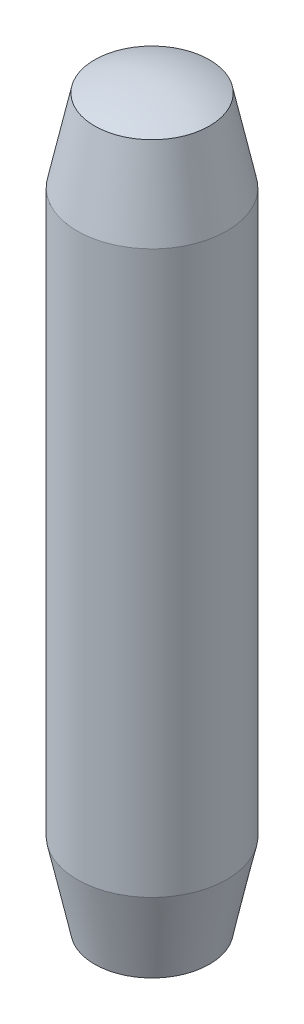
ISO-10303-21;
HEADER;
FILE_DESCRIPTION(('STEP AP214'),'2;1');
FILE_NAME('part.step','',(''),(''),'','','');
FILE_SCHEMA(('AUTOMOTIVE_DESIGN { 1 0 10303 214 1 1 1 1 }'));
ENDSEC;
DATA;
#1=APPLICATION_CONTEXT('core data for automotive mechanical design processes');
#2=APPLICATION_PROTOCOL_DEFINITION('international standard','automotive_design',2000,#1);
#3=PRODUCT_CONTEXT('',#1,'mechanical');
#4=PRODUCT('Part','Part','',(#3));
#5=PRODUCT_RELATED_PRODUCT_CATEGORY('part','',(#4));
#6=PRODUCT_DEFINITION_FORMATION('','',#4);
#7=PRODUCT_DEFINITION_CONTEXT('part definition',#1,'design');
#8=PRODUCT_DEFINITION('design','',#6,#7);
#9=PRODUCT_DEFINITION_SHAPE('','',#8);
#10=(LENGTH_UNIT() NAMED_UNIT(*) SI_UNIT(.MILLI.,.METRE.));
#11=(NAMED_UNIT(*) PLANE_ANGLE_UNIT() SI_UNIT($,.RADIAN.));
#12=(NAMED_UNIT(*) SI_UNIT($,.STERADIAN.) SOLID_ANGLE_UNIT());
#13=UNCERTAINTY_MEASURE_WITH_UNIT(LENGTH_MEASURE(1.E-05),#10,'distance_accuracy_value','');
#14=(GEOMETRIC_REPRESENTATION_CONTEXT(3) GLOBAL_UNCERTAINTY_ASSIGNED_CONTEXT((#13)) GLOBAL_UNIT_ASSIGNED_CONTEXT((#10,
#11,#12)) REPRESENTATION_CONTEXT('',''));
#15=CARTESIAN_POINT('',(0.,0.,0.));
#16=DIRECTION('',(0.,0.,1.));
#17=DIRECTION('',(1.,0.,0.));
#18=AXIS2_PLACEMENT_3D('',#15,#16,#17);
#19=CARTESIAN_POINT('',(0.,4.,0.));
#20=DIRECTION('',(0.,-1.,0.));
#21=DIRECTION('',(0.,0.,-1.));
#22=AXIS2_PLACEMENT_3D('',#19,#20,#21);
#23=CYLINDRICAL_SURFACE('',#22,0.4);
#24=CARTESIAN_POINT('',(0.,3.5,0.));
#25=DIRECTION('',(0.,-1.,0.));
#26=DIRECTION('',(1.,0.,0.));
#27=AXIS2_PLACEMENT_3D('',#24,#25,#26);
#28=CIRCLE('',#27,0.4);
#29=CARTESIAN_POINT('',(0.4,3.5,0.));
#30=VERTEX_POINT('',#29);
#31=EDGE_CURVE('E11',#30,#30,#28,.T.);
#32=ORIENTED_EDGE('',*,*,#31,.T.);
#33=EDGE_LOOP('',(#32));
#34=FACE_BOUND('',#33,.T.);
#35=CARTESIAN_POINT('',(0.,0.5,0.));
#36=DIRECTION('',(0.,-1.,0.));
#37=DIRECTION('',(1.,0.,0.));
#38=AXIS2_PLACEMENT_3D('',#35,#36,#37);
#39=CIRCLE('',#38,0.4);
#40=CARTESIAN_POINT('',(0.4,0.5,0.));
#41=VERTEX_POINT('',#40);
#42=EDGE_CURVE('E56',#41,#41,#39,.T.);
#43=ORIENTED_EDGE('',*,*,#42,.F.);
#44=EDGE_LOOP('',(#43));
#45=FACE_BOUND('',#44,.T.);
#46=ADVANCED_FACE('F34',(#34,#45),#23,.T.);
#47=CARTESIAN_POINT('',(0.,3.5,0.));
#48=DIRECTION('',(0.,-1.,0.));
#49=DIRECTION('',(1.,0.,0.));
#50=AXIS2_PLACEMENT_3D('',#47,#48,#49);
#51=CONICAL_SURFACE('',#50,0.4,0.209439510239313);
#52=CARTESIAN_POINT('',(0.,3.9388676596663,0.));
#53=DIRECTION('',(0.,-1.,0.));
#54=DIRECTION('',(1.,0.,0.));
#55=AXIS2_PLACEMENT_3D('',#52,#53,#54);
#56=CIRCLE('',#55,0.306715799233164);
#57=CARTESIAN_POINT('',(0.306715799233164,3.9388676596663,0.));
#58=VERTEX_POINT('',#57);
#59=EDGE_CURVE('E41',#58,#58,#56,.T.);
#60=ORIENTED_EDGE('',*,*,#59,.T.);
#61=EDGE_LOOP('',(#60));
#62=FACE_BOUND('',#61,.T.);
#63=ORIENTED_EDGE('',*,*,#31,.F.);
#64=EDGE_LOOP('',(#63));
#65=FACE_BOUND('',#64,.T.);
#66=ADVANCED_FACE('F51',(#62,#65),#51,.T.);
#67=CARTESIAN_POINT('',(0.,3.2,0.));
#68=DIRECTION('',(0.,-1.,0.));
#69=DIRECTION('',(1.,0.,0.));
#70=AXIS2_PLACEMENT_3D('',#67,#68,#69);
#71=SPHERICAL_SURFACE('',#70,0.8);
#72=CARTESIAN_POINT('',(0.,4.,0.));
#73=VERTEX_POINT('',#72);
#74=VERTEX_LOOP('',#73);
#75=FACE_BOUND('',#74,.T.);
#76=ORIENTED_EDGE('',*,*,#59,.F.);
#77=EDGE_LOOP('',(#76));
#78=FACE_BOUND('',#77,.T.);
#79=ADVANCED_FACE('F47',(#75,#78),#71,.T.);
#80=CARTESIAN_POINT('',(0.,0.0611323403336963,0.));
#81=DIRECTION('',(0.,1.,0.));
#82=DIRECTION('',(-1.,0.,0.));
#83=AXIS2_PLACEMENT_3D('',#80,#81,#82);
#84=CONICAL_SURFACE('',#83,0.306715799233164,0.209439510239313);
#85=ORIENTED_EDGE('',*,*,#42,.T.);
#86=EDGE_LOOP('',(#85));
#87=FACE_BOUND('',#86,.T.);
#88=CARTESIAN_POINT('',(0.,0.0611323403336963,0.));
#89=DIRECTION('',(0.,-1.,0.));
#90=DIRECTION('',(1.,0.,0.));
#91=AXIS2_PLACEMENT_3D('',#88,#89,#90);
#92=CIRCLE('',#91,0.306715799233164);
#93=CARTESIAN_POINT('',(0.306715799233164,0.0611323403336963,0.));
#94=VERTEX_POINT('',#93);
#95=EDGE_CURVE('E58',#94,#94,#92,.T.);
#96=ORIENTED_EDGE('',*,*,#95,.F.);
#97=EDGE_LOOP('',(#96));
#98=FACE_BOUND('',#97,.T.);
#99=ADVANCED_FACE('F50',(#87,#98),#84,.T.);
#100=CARTESIAN_POINT('',(0.,0.8,0.));
#101=DIRECTION('',(0.,-1.,0.));
#102=DIRECTION('',(1.,0.,0.));
#103=AXIS2_PLACEMENT_3D('',#100,#101,#102);
#104=SPHERICAL_SURFACE('',#103,0.8);
#105=CARTESIAN_POINT('',(0.,0.,0.));
#106=VERTEX_POINT('',#105);
#107=VERTEX_LOOP('',#106);
#108=FACE_BOUND('',#107,.T.);
#109=ORIENTED_EDGE('',*,*,#95,.T.);
#110=EDGE_LOOP('',(#109));
#111=FACE_BOUND('',#110,.T.);
#112=ADVANCED_FACE('F64',(#108,#111),#104,.T.);
#113=CLOSED_SHELL('',(#46,#66,#79,#99,#112));
#114=MANIFOLD_SOLID_BREP('B2',#113);
#115=ADVANCED_BREP_SHAPE_REPRESENTATION('',(#18,#114),#14);
#116=SHAPE_DEFINITION_REPRESENTATION(#9,#115);
ENDSEC;
END-ISO-10303-21;
